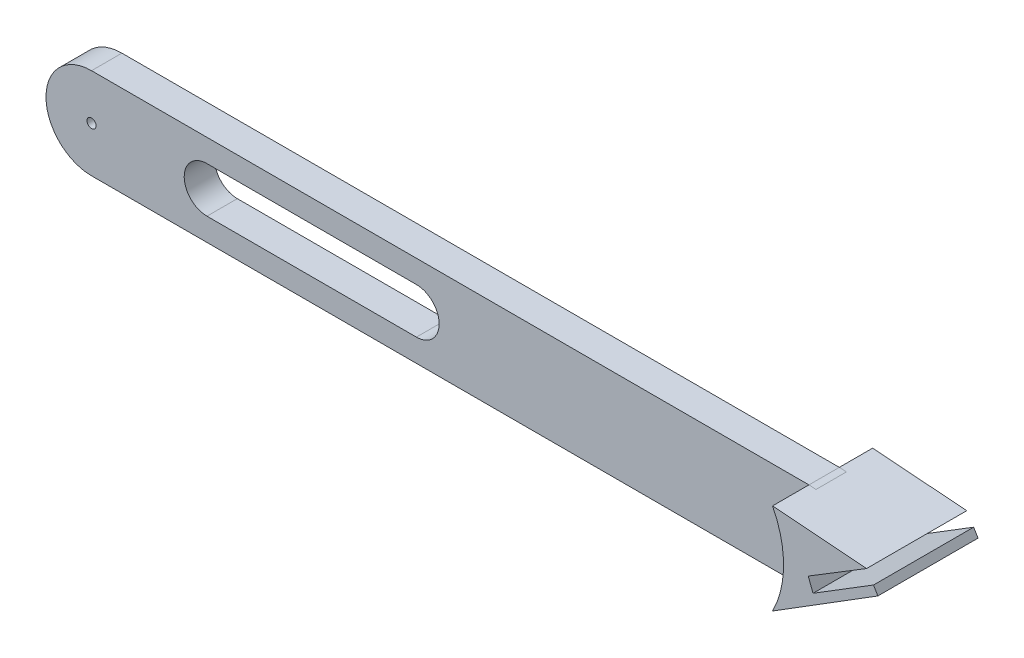
ISO-10303-21;
HEADER;
FILE_DESCRIPTION(('STEP AP214'),'2;1');
FILE_NAME('part.step','',(''),(''),'','','');
FILE_SCHEMA(('AUTOMOTIVE_DESIGN { 1 0 10303 214 1 1 1 1 }'));
ENDSEC;
DATA;
#1=APPLICATION_CONTEXT('core data for automotive mechanical design processes');
#2=APPLICATION_PROTOCOL_DEFINITION('international standard','automotive_design',2000,#1);
#3=PRODUCT_CONTEXT('',#1,'mechanical');
#4=PRODUCT('Part','Part','',(#3));
#5=PRODUCT_RELATED_PRODUCT_CATEGORY('part','',(#4));
#6=PRODUCT_DEFINITION_FORMATION('','',#4);
#7=PRODUCT_DEFINITION_CONTEXT('part definition',#1,'design');
#8=PRODUCT_DEFINITION('design','',#6,#7);
#9=PRODUCT_DEFINITION_SHAPE('','',#8);
#10=(LENGTH_UNIT() NAMED_UNIT(*) SI_UNIT(.MILLI.,.METRE.));
#11=(NAMED_UNIT(*) PLANE_ANGLE_UNIT() SI_UNIT($,.RADIAN.));
#12=(NAMED_UNIT(*) SI_UNIT($,.STERADIAN.) SOLID_ANGLE_UNIT());
#13=UNCERTAINTY_MEASURE_WITH_UNIT(LENGTH_MEASURE(1.E-05),#10,'distance_accuracy_value','');
#14=(GEOMETRIC_REPRESENTATION_CONTEXT(3) GLOBAL_UNCERTAINTY_ASSIGNED_CONTEXT((#13)) GLOBAL_UNIT_ASSIGNED_CONTEXT((#10,
#11,#12)) REPRESENTATION_CONTEXT('',''));
#15=CARTESIAN_POINT('',(0.,0.,0.));
#16=DIRECTION('',(0.,0.,1.));
#17=DIRECTION('',(1.,0.,0.));
#18=AXIS2_PLACEMENT_3D('',#15,#16,#17);
#19=CARTESIAN_POINT('',(64.7841122736278,5.97600908443661,-1.93504881567092));
#20=DIRECTION('',(0.,0.,1.));
#21=DIRECTION('',(1.,0.,0.));
#22=AXIS2_PLACEMENT_3D('',#19,#20,#21);
#23=CYLINDRICAL_SURFACE('',#22,5.);
#24=DIRECTION('',(0.,0.,1.));
#25=VECTOR('',#24,1.);
#26=CARTESIAN_POINT('',(65.5485737937511,10.9172233668019,-1.93504881567092));
#27=LINE('',#26,#25);
#28=CARTESIAN_POINT('',(65.5485737937511,10.9172233668019,-1.93504881567092));
#29=VERTEX_POINT('',#28);
#30=CARTESIAN_POINT('',(65.5485737937511,10.9172233668019,1.4));
#31=VERTEX_POINT('',#30);
#32=EDGE_CURVE('E55',#29,#31,#27,.T.);
#33=ORIENTED_EDGE('',*,*,#32,.F.);
#34=CARTESIAN_POINT('',(64.7841122736278,5.97600908443661,-1.93504881567092));
#35=DIRECTION('',(0.,0.,1.));
#36=DIRECTION('',(1.,0.,0.));
#37=AXIS2_PLACEMENT_3D('',#34,#35,#36);
#38=CIRCLE('',#37,5.);
#39=CARTESIAN_POINT('',(64.7841122736278,10.9760090844366,-1.93504881567092));
#40=VERTEX_POINT('',#39);
#41=EDGE_CURVE('E288',#29,#40,#38,.T.);
#42=ORIENTED_EDGE('',*,*,#41,.T.);
#43=DIRECTION('',(0.,0.,1.));
#44=VECTOR('',#43,1.);
#45=CARTESIAN_POINT('',(64.7841122736278,10.9760090844366,-1.93504881567092));
#46=LINE('',#45,#44);
#47=CARTESIAN_POINT('',(64.7841122736278,10.9760090844366,1.4));
#48=VERTEX_POINT('',#47);
#49=EDGE_CURVE('E166',#40,#48,#46,.T.);
#50=ORIENTED_EDGE('',*,*,#49,.T.);
#51=CARTESIAN_POINT('',(64.7841122736278,5.97600908443661,1.4));
#52=DIRECTION('',(0.,0.,1.));
#53=DIRECTION('',(1.,0.,0.));
#54=AXIS2_PLACEMENT_3D('',#51,#52,#53);
#55=CIRCLE('',#54,5.);
#56=EDGE_CURVE('E177',#31,#48,#55,.T.);
#57=ORIENTED_EDGE('',*,*,#56,.F.);
#58=EDGE_LOOP('',(#33,#42,#50,#57));
#59=FACE_BOUND('',#58,.T.);
#60=ADVANCED_FACE('F39',(#59),#23,.T.);
#61=CARTESIAN_POINT('',(-14.0000000000001,5.97600908443661,-1.93504881567092));
#62=DIRECTION('',(0.,0.,1.));
#63=DIRECTION('',(1.,0.,0.));
#64=AXIS2_PLACEMENT_3D('',#61,#62,#63);
#65=PLANE('',#64);
#66=CARTESIAN_POINT('',(64.7841122736278,5.97600908443661,-1.93504881567092));
#67=DIRECTION('',(0.,0.,-1.));
#68=DIRECTION('',(-1.,0.,0.));
#69=AXIS2_PLACEMENT_3D('',#66,#67,#68);
#70=CIRCLE('',#69,0.5);
#71=CARTESIAN_POINT('',(64.2841122736278,5.97600908443661,-1.93504881567092));
#72=VERTEX_POINT('',#71);
#73=EDGE_CURVE('E218',#72,#72,#70,.T.);
#74=ORIENTED_EDGE('',*,*,#73,.F.);
#75=EDGE_LOOP('',(#74));
#76=FACE_BOUND('',#75,.T.);
#77=CARTESIAN_POINT('',(-14.0000000000001,5.97600908443661,-1.93504881567092));
#78=DIRECTION('',(0.,0.,-1.));
#79=DIRECTION('',(-1.,0.,0.));
#80=AXIS2_PLACEMENT_3D('',#77,#78,#79);
#81=CIRCLE('',#80,0.5);
#82=CARTESIAN_POINT('',(-14.5000000000001,5.97600908443661,-1.93504881567092));
#83=VERTEX_POINT('',#82);
#84=EDGE_CURVE('E226',#83,#83,#81,.T.);
#85=ORIENTED_EDGE('',*,*,#84,.F.);
#86=EDGE_LOOP('',(#85));
#87=FACE_BOUND('',#86,.T.);
#88=DIRECTION('',(1.,0.,0.));
#89=VECTOR('',#88,1.);
#90=CARTESIAN_POINT('',(21.6763205122474,3.47600908443662,-1.93504881567092));
#91=LINE('',#90,#89);
#92=CARTESIAN_POINT('',(-1.32367948775258,3.47600908443662,-1.93504881567092));
#93=VERTEX_POINT('',#92);
#94=CARTESIAN_POINT('',(21.6763205122474,3.47600908443662,-1.93504881567092));
#95=VERTEX_POINT('',#94);
#96=EDGE_CURVE('E266',#93,#95,#91,.T.);
#97=ORIENTED_EDGE('',*,*,#96,.T.);
#98=CARTESIAN_POINT('',(21.6763205122474,5.97600908443661,-1.93504881567092));
#99=DIRECTION('',(0.,0.,1.));
#100=DIRECTION('',(1.,0.,0.));
#101=AXIS2_PLACEMENT_3D('',#98,#99,#100);
#102=CIRCLE('',#101,2.49999999999999);
#103=CARTESIAN_POINT('',(21.6763205122474,8.4760090844366,-1.93504881567092));
#104=VERTEX_POINT('',#103);
#105=EDGE_CURVE('E254',#95,#104,#102,.T.);
#106=ORIENTED_EDGE('',*,*,#105,.T.);
#107=DIRECTION('',(-1.,0.,0.));
#108=VECTOR('',#107,1.);
#109=CARTESIAN_POINT('',(21.6763205122474,8.4760090844366,-1.93504881567092));
#110=LINE('',#109,#108);
#111=CARTESIAN_POINT('',(-1.32367948775258,8.4760090844366,-1.93504881567092));
#112=VERTEX_POINT('',#111);
#113=EDGE_CURVE('E258',#104,#112,#110,.T.);
#114=ORIENTED_EDGE('',*,*,#113,.T.);
#115=CARTESIAN_POINT('',(-1.32367948775258,5.97600908443661,-1.93504881567092));
#116=DIRECTION('',(0.,0.,1.));
#117=DIRECTION('',(1.,0.,0.));
#118=AXIS2_PLACEMENT_3D('',#115,#116,#117);
#119=CIRCLE('',#118,2.49999999999999);
#120=EDGE_CURVE('E262',#112,#93,#119,.T.);
#121=ORIENTED_EDGE('',*,*,#120,.T.);
#122=EDGE_LOOP('',(#97,#106,#114,#121));
#123=FACE_BOUND('',#122,.T.);
#124=DIRECTION('',(-1.,0.,0.));
#125=VECTOR('',#124,1.);
#126=CARTESIAN_POINT('',(-14.0000000000001,10.9760090844366,-1.93504881567092));
#127=LINE('',#126,#125);
#128=CARTESIAN_POINT('',(-14.0000000000001,10.9760090844366,-1.93504881567092));
#129=VERTEX_POINT('',#128);
#130=EDGE_CURVE('E291',#40,#129,#127,.T.);
#131=ORIENTED_EDGE('',*,*,#130,.F.);
#132=CARTESIAN_POINT('',(55.0946709268392,5.97600908443654,-1.93504881567092));
#133=DIRECTION('',(0.,0.,1.));
#134=DIRECTION('',(1.,0.,0.));
#135=AXIS2_PLACEMENT_3D('',#132,#133,#134);
#136=CIRCLE('',#135,10.9034523712839);
#137=CARTESIAN_POINT('',(64.7841122736278,0.976009084436607,-1.93504881567092));
#138=VERTEX_POINT('',#137);
#139=EDGE_CURVE('E215',#40,#138,#136,.F.);
#140=ORIENTED_EDGE('',*,*,#139,.T.);
#141=DIRECTION('',(1.,0.,0.));
#142=VECTOR('',#141,1.);
#143=CARTESIAN_POINT('',(-14.0000000000001,0.976009084436607,-1.93504881567092));
#144=LINE('',#143,#142);
#145=CARTESIAN_POINT('',(-14.0000000000001,0.976009084436607,-1.93504881567092));
#146=VERTEX_POINT('',#145);
#147=EDGE_CURVE('E161',#146,#138,#144,.T.);
#148=ORIENTED_EDGE('',*,*,#147,.F.);
#149=CARTESIAN_POINT('',(-14.0000000000001,5.97600908443661,-1.93504881567092));
#150=DIRECTION('',(0.,0.,1.));
#151=DIRECTION('',(1.,0.,0.));
#152=AXIS2_PLACEMENT_3D('',#149,#150,#151);
#153=CIRCLE('',#152,5.);
#154=EDGE_CURVE('E274',#129,#146,#153,.T.);
#155=ORIENTED_EDGE('',*,*,#154,.F.);
#156=EDGE_LOOP('',(#131,#140,#148,#155));
#157=FACE_BOUND('',#156,.T.);
#158=ADVANCED_FACE('F321',(#76,#87,#123,#157),#65,.F.);
#159=ORIENTED_EDGE('',*,*,#41,.F.);
#160=DIRECTION('',(-0.99705638167384,0.076671844659361,0.));
#161=VECTOR('',#160,1.);
#162=CARTESIAN_POINT('',(-13.1546311821168,16.9693584486448,-1.93504881567092));
#163=LINE('',#162,#161);
#164=EDGE_CURVE('E211',#29,#40,#163,.T.);
#165=ORIENTED_EDGE('',*,*,#164,.T.);
#166=EDGE_LOOP('',(#159,#165));
#167=FACE_BOUND('',#166,.T.);
#168=ADVANCED_FACE('F313',(#167),#65,.F.);
#169=CARTESIAN_POINT('',(-14.0000000000001,5.97600908443661,1.4));
#170=DIRECTION('',(0.,0.,1.));
#171=DIRECTION('',(1.,0.,0.));
#172=AXIS2_PLACEMENT_3D('',#169,#170,#171);
#173=PLANE('',#172);
#174=CARTESIAN_POINT('',(55.0946709268392,5.97600908443654,1.4));
#175=DIRECTION('',(0.,0.,1.));
#176=DIRECTION('',(1.,0.,0.));
#177=AXIS2_PLACEMENT_3D('',#174,#175,#176);
#178=CIRCLE('',#177,10.9034523712839);
#179=CARTESIAN_POINT('',(64.7841122736278,0.976009084436607,1.4));
#180=VERTEX_POINT('',#179);
#181=EDGE_CURVE('E11',#48,#180,#178,.F.);
#182=ORIENTED_EDGE('',*,*,#181,.F.);
#183=DIRECTION('',(-1.,0.,0.));
#184=VECTOR('',#183,1.);
#185=CARTESIAN_POINT('',(-14.0000000000001,10.9760090844366,1.4));
#186=LINE('',#185,#184);
#187=CARTESIAN_POINT('',(-14.0000000000001,10.9760090844366,1.4));
#188=VERTEX_POINT('',#187);
#189=EDGE_CURVE('E251',#48,#188,#186,.T.);
#190=ORIENTED_EDGE('',*,*,#189,.T.);
#191=CARTESIAN_POINT('',(-14.0000000000001,5.97600908443661,1.4));
#192=DIRECTION('',(0.,0.,1.));
#193=DIRECTION('',(1.,0.,0.));
#194=AXIS2_PLACEMENT_3D('',#191,#192,#193);
#195=CIRCLE('',#194,5.);
#196=CARTESIAN_POINT('',(-14.0000000000001,0.976009084436607,1.4));
#197=VERTEX_POINT('',#196);
#198=EDGE_CURVE('E175',#188,#197,#195,.T.);
#199=ORIENTED_EDGE('',*,*,#198,.T.);
#200=DIRECTION('',(1.,0.,0.));
#201=VECTOR('',#200,1.);
#202=CARTESIAN_POINT('',(-14.0000000000001,0.976009084436607,1.4));
#203=LINE('',#202,#201);
#204=EDGE_CURVE('E158',#197,#180,#203,.T.);
#205=ORIENTED_EDGE('',*,*,#204,.T.);
#206=EDGE_LOOP('',(#182,#190,#199,#205));
#207=FACE_BOUND('',#206,.T.);
#208=CARTESIAN_POINT('',(64.7841122736278,5.97600908443661,1.4));
#209=DIRECTION('',(0.,0.,1.));
#210=DIRECTION('',(1.,0.,0.));
#211=AXIS2_PLACEMENT_3D('',#208,#209,#210);
#212=CIRCLE('',#211,0.5);
#213=CARTESIAN_POINT('',(65.2841122736278,5.97600908443661,1.4));
#214=VERTEX_POINT('',#213);
#215=EDGE_CURVE('E222',#214,#214,#212,.T.);
#216=ORIENTED_EDGE('',*,*,#215,.F.);
#217=EDGE_LOOP('',(#216));
#218=FACE_BOUND('',#217,.T.);
#219=CARTESIAN_POINT('',(-14.0000000000001,5.97600908443661,1.4));
#220=DIRECTION('',(0.,0.,1.));
#221=DIRECTION('',(1.,0.,0.));
#222=AXIS2_PLACEMENT_3D('',#219,#220,#221);
#223=CIRCLE('',#222,0.5);
#224=CARTESIAN_POINT('',(-13.5000000000001,5.97600908443661,1.4));
#225=VERTEX_POINT('',#224);
#226=EDGE_CURVE('E230',#225,#225,#223,.T.);
#227=ORIENTED_EDGE('',*,*,#226,.F.);
#228=EDGE_LOOP('',(#227));
#229=FACE_BOUND('',#228,.T.);
#230=DIRECTION('',(-1.,0.,0.));
#231=VECTOR('',#230,1.);
#232=CARTESIAN_POINT('',(21.6763205122474,8.4760090844366,1.4));
#233=LINE('',#232,#231);
#234=CARTESIAN_POINT('',(21.6763205122474,8.4760090844366,1.4));
#235=VERTEX_POINT('',#234);
#236=CARTESIAN_POINT('',(-1.32367948775258,8.4760090844366,1.4));
#237=VERTEX_POINT('',#236);
#238=EDGE_CURVE('E235',#235,#237,#233,.T.);
#239=ORIENTED_EDGE('',*,*,#238,.F.);
#240=CARTESIAN_POINT('',(21.6763205122474,5.97600908443661,1.4));
#241=DIRECTION('',(0.,0.,1.));
#242=DIRECTION('',(1.,0.,0.));
#243=AXIS2_PLACEMENT_3D('',#240,#241,#242);
#244=CIRCLE('',#243,2.49999999999999);
#245=CARTESIAN_POINT('',(21.6763205122474,3.47600908443662,1.4));
#246=VERTEX_POINT('',#245);
#247=EDGE_CURVE('E231',#246,#235,#244,.T.);
#248=ORIENTED_EDGE('',*,*,#247,.F.);
#249=DIRECTION('',(1.,0.,0.));
#250=VECTOR('',#249,1.);
#251=CARTESIAN_POINT('',(21.6763205122474,3.47600908443662,1.4));
#252=LINE('',#251,#250);
#253=CARTESIAN_POINT('',(-1.32367948775258,3.47600908443662,1.4));
#254=VERTEX_POINT('',#253);
#255=EDGE_CURVE('E243',#254,#246,#252,.T.);
#256=ORIENTED_EDGE('',*,*,#255,.F.);
#257=CARTESIAN_POINT('',(-1.32367948775258,5.97600908443661,1.4));
#258=DIRECTION('',(0.,0.,1.));
#259=DIRECTION('',(1.,0.,0.));
#260=AXIS2_PLACEMENT_3D('',#257,#258,#259);
#261=CIRCLE('',#260,2.49999999999999);
#262=EDGE_CURVE('E239',#237,#254,#261,.T.);
#263=ORIENTED_EDGE('',*,*,#262,.F.);
#264=EDGE_LOOP('',(#239,#248,#256,#263));
#265=FACE_BOUND('',#264,.T.);
#266=ADVANCED_FACE('F171',(#207,#218,#229,#265),#173,.T.);
#267=DIRECTION('',(-0.99705638167384,0.076671844659361,0.));
#268=VECTOR('',#267,1.);
#269=CARTESIAN_POINT('',(-13.1546311821168,16.9693584486448,1.4));
#270=LINE('',#269,#268);
#271=EDGE_CURVE('E48',#31,#48,#270,.T.);
#272=ORIENTED_EDGE('',*,*,#271,.F.);
#273=ORIENTED_EDGE('',*,*,#56,.T.);
#274=EDGE_LOOP('',(#272,#273));
#275=FACE_BOUND('',#274,.T.);
#276=ADVANCED_FACE('F433',(#275),#173,.T.);
#277=CARTESIAN_POINT('',(-14.0000000000001,5.97600908443661,-1.93504881567092));
#278=DIRECTION('',(0.,0.,1.));
#279=DIRECTION('',(1.,0.,0.));
#280=AXIS2_PLACEMENT_3D('',#277,#278,#279);
#281=CYLINDRICAL_SURFACE('',#280,5.);
#282=DIRECTION('',(0.,0.,1.));
#283=VECTOR('',#282,1.);
#284=CARTESIAN_POINT('',(-14.0000000000001,0.976009084436607,-1.93504881567092));
#285=LINE('',#284,#283);
#286=EDGE_CURVE('E167',#146,#197,#285,.T.);
#287=ORIENTED_EDGE('',*,*,#286,.T.);
#288=ORIENTED_EDGE('',*,*,#198,.F.);
#289=DIRECTION('',(0.,0.,1.));
#290=VECTOR('',#289,1.);
#291=CARTESIAN_POINT('',(-14.0000000000001,10.9760090844366,-1.93504881567092));
#292=LINE('',#291,#290);
#293=EDGE_CURVE('E295',#129,#188,#292,.T.);
#294=ORIENTED_EDGE('',*,*,#293,.F.);
#295=ORIENTED_EDGE('',*,*,#154,.T.);
#296=EDGE_LOOP('',(#287,#288,#294,#295));
#297=FACE_BOUND('',#296,.T.);
#298=ADVANCED_FACE('F41',(#297),#281,.T.);
#299=CARTESIAN_POINT('',(-14.0000000000001,10.9760090844366,-1.93504881567092));
#300=DIRECTION('',(0.,1.,0.));
#301=DIRECTION('',(0.,0.,1.));
#302=AXIS2_PLACEMENT_3D('',#299,#300,#301);
#303=PLANE('',#302);
#304=ORIENTED_EDGE('',*,*,#293,.T.);
#305=ORIENTED_EDGE('',*,*,#189,.F.);
#306=ORIENTED_EDGE('',*,*,#49,.F.);
#307=ORIENTED_EDGE('',*,*,#130,.T.);
#308=EDGE_LOOP('',(#304,#305,#306,#307));
#309=FACE_BOUND('',#308,.T.);
#310=ADVANCED_FACE('F317',(#309),#303,.T.);
#311=CARTESIAN_POINT('',(-14.0000000000001,0.976009084436607,-1.93504881567092));
#312=DIRECTION('',(0.,-1.,0.));
#313=DIRECTION('',(0.,0.,-1.));
#314=AXIS2_PLACEMENT_3D('',#311,#312,#313);
#315=PLANE('',#314);
#316=DIRECTION('',(0.,0.,1.));
#317=VECTOR('',#316,1.);
#318=CARTESIAN_POINT('',(64.7841122736278,0.976009084436607,-1.93504881567092));
#319=LINE('',#318,#317);
#320=EDGE_CURVE('E155',#138,#180,#319,.T.);
#321=ORIENTED_EDGE('',*,*,#320,.T.);
#322=ORIENTED_EDGE('',*,*,#204,.F.);
#323=ORIENTED_EDGE('',*,*,#286,.F.);
#324=ORIENTED_EDGE('',*,*,#147,.T.);
#325=EDGE_LOOP('',(#321,#322,#323,#324));
#326=FACE_BOUND('',#325,.T.);
#327=ADVANCED_FACE('F157',(#326),#315,.T.);
#328=CARTESIAN_POINT('',(21.6763205122474,5.97600908443661,-1.93504881567092));
#329=DIRECTION('',(0.,0.,1.));
#330=DIRECTION('',(1.,0.,0.));
#331=AXIS2_PLACEMENT_3D('',#328,#329,#330);
#332=CYLINDRICAL_SURFACE('',#331,2.49999999999999);
#333=DIRECTION('',(0.,0.,1.));
#334=VECTOR('',#333,1.);
#335=CARTESIAN_POINT('',(21.6763205122474,3.47600908443662,-1.93504881567092));
#336=LINE('',#335,#334);
#337=EDGE_CURVE('E271',#95,#246,#336,.T.);
#338=ORIENTED_EDGE('',*,*,#337,.T.);
#339=ORIENTED_EDGE('',*,*,#247,.T.);
#340=DIRECTION('',(0.,0.,1.));
#341=VECTOR('',#340,1.);
#342=CARTESIAN_POINT('',(21.6763205122474,8.4760090844366,-1.93504881567092));
#343=LINE('',#342,#341);
#344=EDGE_CURVE('E270',#104,#235,#343,.T.);
#345=ORIENTED_EDGE('',*,*,#344,.F.);
#346=ORIENTED_EDGE('',*,*,#105,.F.);
#347=EDGE_LOOP('',(#338,#339,#345,#346));
#348=FACE_BOUND('',#347,.T.);
#349=ADVANCED_FACE('F422',(#348),#332,.F.);
#350=CARTESIAN_POINT('',(21.6763205122474,3.47600908443662,-1.93504881567092));
#351=DIRECTION('',(0.,-1.,0.));
#352=DIRECTION('',(1.,0.,0.));
#353=AXIS2_PLACEMENT_3D('',#350,#351,#352);
#354=PLANE('',#353);
#355=DIRECTION('',(0.,0.,1.));
#356=VECTOR('',#355,1.);
#357=CARTESIAN_POINT('',(-1.32367948775258,3.47600908443662,-1.93504881567092));
#358=LINE('',#357,#356);
#359=EDGE_CURVE('E275',#93,#254,#358,.T.);
#360=ORIENTED_EDGE('',*,*,#359,.T.);
#361=ORIENTED_EDGE('',*,*,#255,.T.);
#362=ORIENTED_EDGE('',*,*,#337,.F.);
#363=ORIENTED_EDGE('',*,*,#96,.F.);
#364=EDGE_LOOP('',(#360,#361,#362,#363));
#365=FACE_BOUND('',#364,.T.);
#366=ADVANCED_FACE('F427',(#365),#354,.F.);
#367=CARTESIAN_POINT('',(-1.32367948775258,5.97600908443661,-1.93504881567092));
#368=DIRECTION('',(0.,0.,1.));
#369=DIRECTION('',(1.,0.,0.));
#370=AXIS2_PLACEMENT_3D('',#367,#368,#369);
#371=CYLINDRICAL_SURFACE('',#370,2.49999999999999);
#372=DIRECTION('',(0.,0.,1.));
#373=VECTOR('',#372,1.);
#374=CARTESIAN_POINT('',(-1.32367948775258,8.4760090844366,-1.93504881567092));
#375=LINE('',#374,#373);
#376=EDGE_CURVE('E278',#112,#237,#375,.T.);
#377=ORIENTED_EDGE('',*,*,#376,.T.);
#378=ORIENTED_EDGE('',*,*,#262,.T.);
#379=ORIENTED_EDGE('',*,*,#359,.F.);
#380=ORIENTED_EDGE('',*,*,#120,.F.);
#381=EDGE_LOOP('',(#377,#378,#379,#380));
#382=FACE_BOUND('',#381,.T.);
#383=ADVANCED_FACE('F448',(#382),#371,.F.);
#384=CARTESIAN_POINT('',(21.6763205122474,8.4760090844366,-1.93504881567092));
#385=DIRECTION('',(0.,1.,0.));
#386=DIRECTION('',(-1.,0.,0.));
#387=AXIS2_PLACEMENT_3D('',#384,#385,#386);
#388=PLANE('',#387);
#389=ORIENTED_EDGE('',*,*,#344,.T.);
#390=ORIENTED_EDGE('',*,*,#238,.T.);
#391=ORIENTED_EDGE('',*,*,#376,.F.);
#392=ORIENTED_EDGE('',*,*,#113,.F.);
#393=EDGE_LOOP('',(#389,#390,#391,#392));
#394=FACE_BOUND('',#393,.T.);
#395=ADVANCED_FACE('F452',(#394),#388,.F.);
#396=CARTESIAN_POINT('',(-14.0000000000001,5.97600908443661,-1.93504881567092));
#397=DIRECTION('',(0.,0.,-1.));
#398=DIRECTION('',(-1.,0.,0.));
#399=AXIS2_PLACEMENT_3D('',#396,#397,#398);
#400=CYLINDRICAL_SURFACE('',#399,0.5);
#401=ORIENTED_EDGE('',*,*,#226,.T.);
#402=EDGE_LOOP('',(#401));
#403=FACE_BOUND('',#402,.T.);
#404=ORIENTED_EDGE('',*,*,#84,.T.);
#405=EDGE_LOOP('',(#404));
#406=FACE_BOUND('',#405,.T.);
#407=ADVANCED_FACE('F444',(#403,#406),#400,.F.);
#408=CARTESIAN_POINT('',(64.7841122736278,5.97600908443661,-1.93504881567092));
#409=DIRECTION('',(0.,0.,-1.));
#410=DIRECTION('',(-1.,0.,0.));
#411=AXIS2_PLACEMENT_3D('',#408,#409,#410);
#412=CYLINDRICAL_SURFACE('',#411,0.5);
#413=ORIENTED_EDGE('',*,*,#215,.T.);
#414=EDGE_LOOP('',(#413));
#415=FACE_BOUND('',#414,.T.);
#416=ORIENTED_EDGE('',*,*,#73,.T.);
#417=EDGE_LOOP('',(#416));
#418=FACE_BOUND('',#417,.T.);
#419=ADVANCED_FACE('F409',(#415,#418),#412,.F.);
#420=CARTESIAN_POINT('',(69.2310744182836,4.88985116031874,-5.6));
#421=DIRECTION('',(0.934379066936633,0.356280450306535,0.));
#422=DIRECTION('',(-0.356280450306535,0.934379066936633,0.));
#423=AXIS2_PLACEMENT_3D('',#420,#421,#422);
#424=PLANE('',#423);
#425=DIRECTION('',(0.,0.,1.));
#426=VECTOR('',#425,1.);
#427=CARTESIAN_POINT('',(68.7064801614934,6.26564905144131,-5.6));
#428=LINE('',#427,#426);
#429=CARTESIAN_POINT('',(68.7064801614934,6.26564905144131,-5.6));
#430=VERTEX_POINT('',#429);
#431=CARTESIAN_POINT('',(68.7064801614934,6.26564905144131,5.4));
#432=VERTEX_POINT('',#431);
#433=EDGE_CURVE('E205',#430,#432,#428,.T.);
#434=ORIENTED_EDGE('',*,*,#433,.T.);
#435=DIRECTION('',(-0.356280450306535,0.934379066936633,0.));
#436=VECTOR('',#435,1.);
#437=CARTESIAN_POINT('',(69.2310744182836,4.88985116031874,5.4));
#438=LINE('',#437,#436);
#439=CARTESIAN_POINT('',(69.2310744182836,4.88985116031874,5.4));
#440=VERTEX_POINT('',#439);
#441=EDGE_CURVE('E391',#440,#432,#438,.T.);
#442=ORIENTED_EDGE('',*,*,#441,.F.);
#443=DIRECTION('',(0.,0.,1.));
#444=VECTOR('',#443,1.);
#445=CARTESIAN_POINT('',(69.2310744182836,4.88985116031874,-5.6));
#446=LINE('',#445,#444);
#447=CARTESIAN_POINT('',(69.2310744182836,4.88985116031874,-5.6));
#448=VERTEX_POINT('',#447);
#449=EDGE_CURVE('E212',#448,#440,#446,.T.);
#450=ORIENTED_EDGE('',*,*,#449,.F.);
#451=DIRECTION('',(-0.356280450306535,0.934379066936633,0.));
#452=VECTOR('',#451,1.);
#453=CARTESIAN_POINT('',(69.2310744182836,4.88985116031874,-5.6));
#454=LINE('',#453,#452);
#455=EDGE_CURVE('E371',#448,#430,#454,.T.);
#456=ORIENTED_EDGE('',*,*,#455,.T.);
#457=EDGE_LOOP('',(#434,#442,#450,#456));
#458=FACE_BOUND('',#457,.T.);
#459=ADVANCED_FACE('F390',(#458),#424,.T.);
#460=CARTESIAN_POINT('',(75.8768047151884,9.00126878425758,-5.6));
#461=DIRECTION('',(-0.526113517872476,0.850414349780063,0.));
#462=DIRECTION('',(-0.850414349780064,-0.526113517872476,0.));
#463=AXIS2_PLACEMENT_3D('',#460,#461,#462);
#464=PLANE('',#463);
#465=DIRECTION('',(-0.850414349780063,-0.526113517872476,0.));
#466=VECTOR('',#465,1.);
#467=CARTESIAN_POINT('',(75.8768047151884,9.00126878425758,-5.6));
#468=LINE('',#467,#466);
#469=CARTESIAN_POINT('',(75.8768047151884,9.00126878425758,-5.6));
#470=VERTEX_POINT('',#469);
#471=EDGE_CURVE('E208',#470,#448,#468,.T.);
#472=ORIENTED_EDGE('',*,*,#471,.T.);
#473=ORIENTED_EDGE('',*,*,#449,.T.);
#474=DIRECTION('',(-0.850414349780063,-0.526113517872476,0.));
#475=VECTOR('',#474,1.);
#476=CARTESIAN_POINT('',(75.8768047151884,9.00126878425758,5.4));
#477=LINE('',#476,#475);
#478=CARTESIAN_POINT('',(75.8768047151884,9.00126878425758,5.4));
#479=VERTEX_POINT('',#478);
#480=EDGE_CURVE('E368',#479,#440,#477,.T.);
#481=ORIENTED_EDGE('',*,*,#480,.F.);
#482=DIRECTION('',(0.,0.,1.));
#483=VECTOR('',#482,1.);
#484=CARTESIAN_POINT('',(75.8768047151884,9.00126878425758,-5.6));
#485=LINE('',#484,#483);
#486=EDGE_CURVE('E351',#470,#479,#485,.T.);
#487=ORIENTED_EDGE('',*,*,#486,.F.);
#488=EDGE_LOOP('',(#472,#473,#481,#487));
#489=FACE_BOUND('',#488,.T.);
#490=ADVANCED_FACE('F393',(#489),#464,.T.);
#491=CARTESIAN_POINT('',(64.7841122736278,0.976009084436607,-5.6));
#492=DIRECTION('',(0.529257478004798,-0.848461267222023,0.));
#493=DIRECTION('',(0.848461267222023,0.529257478004798,0.));
#494=AXIS2_PLACEMENT_3D('',#491,#492,#493);
#495=PLANE('',#494);
#496=ORIENTED_EDGE('',*,*,#320,.F.);
#497=DIRECTION('',(0.,0.,1.));
#498=VECTOR('',#497,1.);
#499=CARTESIAN_POINT('',(64.7841122736278,0.976009084436608,-5.6));
#500=LINE('',#499,#498);
#501=CARTESIAN_POINT('',(64.7841122736278,0.976009084436608,-5.6));
#502=VERTEX_POINT('',#501);
#503=EDGE_CURVE('E191',#502,#138,#500,.T.);
#504=ORIENTED_EDGE('',*,*,#503,.F.);
#505=DIRECTION('',(0.848461267222023,0.529257478004798,0.));
#506=VECTOR('',#505,1.);
#507=CARTESIAN_POINT('',(64.7841122736278,0.976009084436607,-5.6));
#508=LINE('',#507,#506);
#509=CARTESIAN_POINT('',(76.3487646371988,8.18986666450705,-5.6));
#510=VERTEX_POINT('',#509);
#511=EDGE_CURVE('E329',#502,#510,#508,.T.);
#512=ORIENTED_EDGE('',*,*,#511,.T.);
#513=DIRECTION('',(0.,0.,1.));
#514=VECTOR('',#513,1.);
#515=CARTESIAN_POINT('',(76.3487646371988,8.18986666450705,-5.6));
#516=LINE('',#515,#514);
#517=CARTESIAN_POINT('',(76.3487646371988,8.18986666450705,5.4));
#518=VERTEX_POINT('',#517);
#519=EDGE_CURVE('E196',#510,#518,#516,.T.);
#520=ORIENTED_EDGE('',*,*,#519,.T.);
#521=DIRECTION('',(0.848461267222023,0.529257478004798,0.));
#522=VECTOR('',#521,1.);
#523=CARTESIAN_POINT('',(64.7841122736278,0.976009084436607,5.4));
#524=LINE('',#523,#522);
#525=CARTESIAN_POINT('',(64.7841122736278,0.976009084436608,5.4));
#526=VERTEX_POINT('',#525);
#527=EDGE_CURVE('E189',#526,#518,#524,.T.);
#528=ORIENTED_EDGE('',*,*,#527,.F.);
#529=EDGE_CURVE('E183',#180,#526,#500,.T.);
#530=ORIENTED_EDGE('',*,*,#529,.F.);
#531=EDGE_LOOP('',(#496,#504,#512,#520,#528,#530));
#532=FACE_BOUND('',#531,.T.);
#533=ADVANCED_FACE('F187',(#532),#495,.T.);
#534=CARTESIAN_POINT('',(55.0946709268392,5.97600908443654,-5.6));
#535=DIRECTION('',(0.,0.,1.));
#536=DIRECTION('',(1.,0.,0.));
#537=AXIS2_PLACEMENT_3D('',#534,#535,#536);
#538=CYLINDRICAL_SURFACE('',#537,10.9034523712839);
#539=ORIENTED_EDGE('',*,*,#139,.F.);
#540=DIRECTION('',(0.,0.,1.));
#541=VECTOR('',#540,1.);
#542=CARTESIAN_POINT('',(64.7841122736278,10.9760090844366,-5.6));
#543=LINE('',#542,#541);
#544=CARTESIAN_POINT('',(64.7841122736278,10.9760090844366,-5.6));
#545=VERTEX_POINT('',#544);
#546=EDGE_CURVE('E192',#545,#40,#543,.T.);
#547=ORIENTED_EDGE('',*,*,#546,.F.);
#548=CARTESIAN_POINT('',(55.0946709268392,5.97600908443654,-5.6));
#549=DIRECTION('',(0.,0.,-1.));
#550=DIRECTION('',(-1.,0.,0.));
#551=AXIS2_PLACEMENT_3D('',#548,#549,#550);
#552=CIRCLE('',#551,10.9034523712839);
#553=EDGE_CURVE('E326',#545,#502,#552,.T.);
#554=ORIENTED_EDGE('',*,*,#553,.T.);
#555=ORIENTED_EDGE('',*,*,#503,.T.);
#556=EDGE_LOOP('',(#539,#547,#554,#555));
#557=FACE_BOUND('',#556,.T.);
#558=ADVANCED_FACE('F323',(#557),#538,.F.);
#559=CARTESIAN_POINT('',(64.7841122736278,10.9760090844366,-5.6));
#560=DIRECTION('',(0.076671844659361,0.99705638167384,0.));
#561=DIRECTION('',(-0.99705638167384,0.076671844659361,0.));
#562=AXIS2_PLACEMENT_3D('',#559,#560,#561);
#563=PLANE('',#562);
#564=ORIENTED_EDGE('',*,*,#164,.F.);
#565=ORIENTED_EDGE('',*,*,#32,.T.);
#566=ORIENTED_EDGE('',*,*,#271,.T.);
#567=CARTESIAN_POINT('',(64.7841122736278,10.9760090844366,5.4));
#568=VERTEX_POINT('',#567);
#569=EDGE_CURVE('E185',#48,#568,#543,.T.);
#570=ORIENTED_EDGE('',*,*,#569,.T.);
#571=DIRECTION('',(-0.99705638167384,0.076671844659361,0.));
#572=VECTOR('',#571,1.);
#573=CARTESIAN_POINT('',(64.7841122736278,10.9760090844366,5.4));
#574=LINE('',#573,#572);
#575=CARTESIAN_POINT('',(75.110274270052,10.1819457766143,5.4));
#576=VERTEX_POINT('',#575);
#577=EDGE_CURVE('E397',#576,#568,#574,.T.);
#578=ORIENTED_EDGE('',*,*,#577,.F.);
#579=DIRECTION('',(0.,0.,1.));
#580=VECTOR('',#579,1.);
#581=CARTESIAN_POINT('',(75.110274270052,10.1819457766143,-5.6));
#582=LINE('',#581,#580);
#583=CARTESIAN_POINT('',(75.110274270052,10.1819457766143,-5.6));
#584=VERTEX_POINT('',#583);
#585=EDGE_CURVE('E202',#584,#576,#582,.T.);
#586=ORIENTED_EDGE('',*,*,#585,.F.);
#587=DIRECTION('',(-0.99705638167384,0.076671844659361,0.));
#588=VECTOR('',#587,1.);
#589=CARTESIAN_POINT('',(64.7841122736278,10.9760090844366,-5.6));
#590=LINE('',#589,#588);
#591=EDGE_CURVE('E343',#584,#545,#590,.T.);
#592=ORIENTED_EDGE('',*,*,#591,.T.);
#593=ORIENTED_EDGE('',*,*,#546,.T.);
#594=EDGE_LOOP('',(#564,#565,#566,#570,#578,#586,#592,#593));
#595=FACE_BOUND('',#594,.T.);
#596=ADVANCED_FACE('F308',(#595),#563,.T.);
#597=CARTESIAN_POINT('',(68.7064801614934,6.26564905144131,-5.6));
#598=DIRECTION('',(0.521728068397285,-0.85311184650457,0.));
#599=DIRECTION('',(0.85311184650457,0.521728068397285,0.));
#600=AXIS2_PLACEMENT_3D('',#597,#598,#599);
#601=PLANE('',#600);
#602=DIRECTION('',(0.853111846504571,0.521728068397285,0.));
#603=VECTOR('',#602,1.);
#604=CARTESIAN_POINT('',(68.7064801614934,6.26564905144131,5.4));
#605=LINE('',#604,#603);
#606=EDGE_CURVE('E387',#432,#576,#605,.T.);
#607=ORIENTED_EDGE('',*,*,#606,.F.);
#608=ORIENTED_EDGE('',*,*,#433,.F.);
#609=DIRECTION('',(0.853111846504571,0.521728068397285,0.));
#610=VECTOR('',#609,1.);
#611=CARTESIAN_POINT('',(68.7064801614934,6.26564905144131,-5.6));
#612=LINE('',#611,#610);
#613=EDGE_CURVE('E378',#430,#584,#612,.T.);
#614=ORIENTED_EDGE('',*,*,#613,.T.);
#615=ORIENTED_EDGE('',*,*,#585,.T.);
#616=EDGE_LOOP('',(#607,#608,#614,#615));
#617=FACE_BOUND('',#616,.T.);
#618=ADVANCED_FACE('F385',(#617),#601,.T.);
#619=CARTESIAN_POINT('',(76.3487646371988,8.18986666450705,-5.6));
#620=DIRECTION('',(0.864407875168461,0.502791234357507,0.));
#621=DIRECTION('',(-0.502791234357507,0.864407875168461,0.));
#622=AXIS2_PLACEMENT_3D('',#619,#620,#621);
#623=PLANE('',#622);
#624=ORIENTED_EDGE('',*,*,#486,.T.);
#625=DIRECTION('',(-0.502791234357507,0.864407875168461,0.));
#626=VECTOR('',#625,1.);
#627=CARTESIAN_POINT('',(76.3487646371988,8.18986666450705,5.4));
#628=LINE('',#627,#626);
#629=EDGE_CURVE('E361',#518,#479,#628,.T.);
#630=ORIENTED_EDGE('',*,*,#629,.F.);
#631=ORIENTED_EDGE('',*,*,#519,.F.);
#632=DIRECTION('',(-0.502791234357507,0.864407875168461,0.));
#633=VECTOR('',#632,1.);
#634=CARTESIAN_POINT('',(76.3487646371988,8.18986666450705,-5.6));
#635=LINE('',#634,#633);
#636=EDGE_CURVE('E337',#510,#470,#635,.T.);
#637=ORIENTED_EDGE('',*,*,#636,.T.);
#638=EDGE_LOOP('',(#624,#630,#631,#637));
#639=FACE_BOUND('',#638,.T.);
#640=ADVANCED_FACE('F366',(#639),#623,.T.);
#641=ORIENTED_EDGE('',*,*,#569,.F.);
#642=ORIENTED_EDGE('',*,*,#181,.T.);
#643=ORIENTED_EDGE('',*,*,#529,.T.);
#644=CARTESIAN_POINT('',(55.0946709268392,5.97600908443654,5.4));
#645=DIRECTION('',(0.,0.,-1.));
#646=DIRECTION('',(-1.,0.,0.));
#647=AXIS2_PLACEMENT_3D('',#644,#645,#646);
#648=CIRCLE('',#647,10.9034523712839);
#649=EDGE_CURVE('E363',#568,#526,#648,.T.);
#650=ORIENTED_EDGE('',*,*,#649,.F.);
#651=EDGE_LOOP('',(#641,#642,#643,#650));
#652=FACE_BOUND('',#651,.T.);
#653=ADVANCED_FACE('F181',(#652),#538,.F.);
#654=CARTESIAN_POINT('',(55.0946709268392,5.97600908443654,-5.6));
#655=DIRECTION('',(0.,0.,-1.));
#656=DIRECTION('',(-1.,0.,0.));
#657=AXIS2_PLACEMENT_3D('',#654,#655,#656);
#658=PLANE('',#657);
#659=ORIENTED_EDGE('',*,*,#455,.F.);
#660=ORIENTED_EDGE('',*,*,#471,.F.);
#661=ORIENTED_EDGE('',*,*,#636,.F.);
#662=ORIENTED_EDGE('',*,*,#511,.F.);
#663=ORIENTED_EDGE('',*,*,#553,.F.);
#664=ORIENTED_EDGE('',*,*,#591,.F.);
#665=ORIENTED_EDGE('',*,*,#613,.F.);
#666=EDGE_LOOP('',(#659,#660,#661,#662,#663,#664,#665));
#667=FACE_BOUND('',#666,.T.);
#668=ADVANCED_FACE('F333',(#667),#658,.T.);
#669=CARTESIAN_POINT('',(55.0946709268392,5.97600908443654,5.4));
#670=DIRECTION('',(0.,0.,-1.));
#671=DIRECTION('',(-1.,0.,0.));
#672=AXIS2_PLACEMENT_3D('',#669,#670,#671);
#673=PLANE('',#672);
#674=ORIENTED_EDGE('',*,*,#441,.T.);
#675=ORIENTED_EDGE('',*,*,#606,.T.);
#676=ORIENTED_EDGE('',*,*,#577,.T.);
#677=ORIENTED_EDGE('',*,*,#649,.T.);
#678=ORIENTED_EDGE('',*,*,#527,.T.);
#679=ORIENTED_EDGE('',*,*,#629,.T.);
#680=ORIENTED_EDGE('',*,*,#480,.T.);
#681=EDGE_LOOP('',(#674,#675,#676,#677,#678,#679,#680));
#682=FACE_BOUND('',#681,.T.);
#683=ADVANCED_FACE('F359',(#682),#673,.F.);
#684=CLOSED_SHELL('',(#60,#158,#168,#266,#276,#298,#310,#327,#349,#366,#383,#395,#407,#419,#459,
#490,#533,#558,#596,#618,#640,#653,#668,#683));
#685=MANIFOLD_SOLID_BREP('B2',#684);
#686=ADVANCED_BREP_SHAPE_REPRESENTATION('',(#18,#685),#14);
#687=SHAPE_DEFINITION_REPRESENTATION(#9,#686);
ENDSEC;
END-ISO-10303-21;
